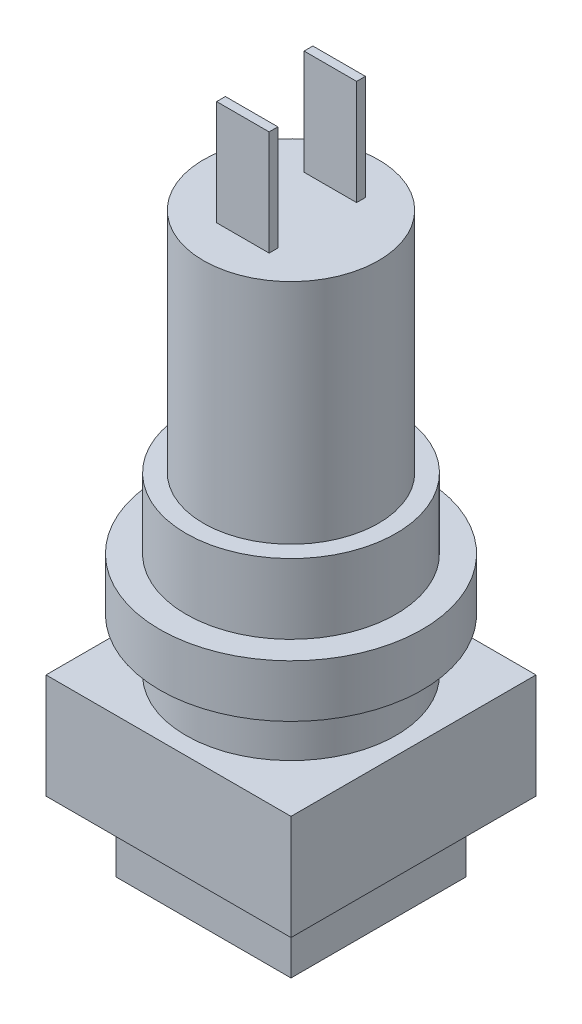
ISO-10303-21;
HEADER;
FILE_DESCRIPTION(('STEP AP214'),'2;1');
FILE_NAME('part.step','',(''),(''),'','','');
FILE_SCHEMA(('AUTOMOTIVE_DESIGN { 1 0 10303 214 1 1 1 1 }'));
ENDSEC;
DATA;
#1=APPLICATION_CONTEXT('core data for automotive mechanical design processes');
#2=APPLICATION_PROTOCOL_DEFINITION('international standard','automotive_design',2000,#1);
#3=PRODUCT_CONTEXT('',#1,'mechanical');
#4=PRODUCT('Part','Part','',(#3));
#5=PRODUCT_RELATED_PRODUCT_CATEGORY('part','',(#4));
#6=PRODUCT_DEFINITION_FORMATION('','',#4);
#7=PRODUCT_DEFINITION_CONTEXT('part definition',#1,'design');
#8=PRODUCT_DEFINITION('design','',#6,#7);
#9=PRODUCT_DEFINITION_SHAPE('','',#8);
#10=(LENGTH_UNIT() NAMED_UNIT(*) SI_UNIT(.MILLI.,.METRE.));
#11=(NAMED_UNIT(*) PLANE_ANGLE_UNIT() SI_UNIT($,.RADIAN.));
#12=(NAMED_UNIT(*) SI_UNIT($,.STERADIAN.) SOLID_ANGLE_UNIT());
#13=UNCERTAINTY_MEASURE_WITH_UNIT(LENGTH_MEASURE(1.E-05),#10,'distance_accuracy_value','');
#14=(GEOMETRIC_REPRESENTATION_CONTEXT(3) GLOBAL_UNCERTAINTY_ASSIGNED_CONTEXT((#13)) GLOBAL_UNIT_ASSIGNED_CONTEXT((#10,
#11,#12)) REPRESENTATION_CONTEXT('',''));
#15=CARTESIAN_POINT('',(0.,0.,0.));
#16=DIRECTION('',(0.,0.,1.));
#17=DIRECTION('',(1.,0.,0.));
#18=AXIS2_PLACEMENT_3D('',#15,#16,#17);
#19=CARTESIAN_POINT('',(0.,33.,0.));
#20=DIRECTION('',(0.,1.,0.));
#21=DIRECTION('',(0.,0.,1.));
#22=AXIS2_PLACEMENT_3D('',#19,#20,#21);
#23=PLANE('',#22);
#24=CARTESIAN_POINT('',(0.,33.,0.));
#25=DIRECTION('',(0.,1.,0.));
#26=DIRECTION('',(0.,0.,1.));
#27=AXIS2_PLACEMENT_3D('',#24,#25,#26);
#28=CIRCLE('',#27,5.);
#29=CARTESIAN_POINT('',(0.,33.,5.));
#30=VERTEX_POINT('',#29);
#31=EDGE_CURVE('E210',#30,#30,#28,.T.);
#32=ORIENTED_EDGE('',*,*,#31,.T.);
#33=EDGE_LOOP('',(#32));
#34=FACE_BOUND('',#33,.T.);
#35=DIRECTION('',(0.,0.,-1.));
#36=VECTOR('',#35,1.);
#37=CARTESIAN_POINT('',(1.5,33.,0.));
#38=LINE('',#37,#36);
#39=CARTESIAN_POINT('',(1.5,33.,-2.25));
#40=VERTEX_POINT('',#39);
#41=CARTESIAN_POINT('',(1.5,33.,-2.75));
#42=VERTEX_POINT('',#41);
#43=EDGE_CURVE('E193',#40,#42,#38,.T.);
#44=ORIENTED_EDGE('',*,*,#43,.F.);
#45=DIRECTION('',(1.,0.,0.));
#46=VECTOR('',#45,1.);
#47=CARTESIAN_POINT('',(0.,33.,-2.25));
#48=LINE('',#47,#46);
#49=CARTESIAN_POINT('',(-1.5,33.,-2.25));
#50=VERTEX_POINT('',#49);
#51=EDGE_CURVE('E152',#50,#40,#48,.T.);
#52=ORIENTED_EDGE('',*,*,#51,.F.);
#53=DIRECTION('',(0.,0.,-1.));
#54=VECTOR('',#53,1.);
#55=CARTESIAN_POINT('',(-1.5,33.,0.));
#56=LINE('',#55,#54);
#57=CARTESIAN_POINT('',(-1.5,33.,-2.75));
#58=VERTEX_POINT('',#57);
#59=EDGE_CURVE('E182',#50,#58,#56,.T.);
#60=ORIENTED_EDGE('',*,*,#59,.T.);
#61=DIRECTION('',(1.,0.,0.));
#62=VECTOR('',#61,1.);
#63=CARTESIAN_POINT('',(0.,33.,-2.75));
#64=LINE('',#63,#62);
#65=EDGE_CURVE('E196',#58,#42,#64,.T.);
#66=ORIENTED_EDGE('',*,*,#65,.T.);
#67=EDGE_LOOP('',(#44,#52,#60,#66));
#68=FACE_BOUND('',#67,.T.);
#69=DIRECTION('',(1.,0.,0.));
#70=VECTOR('',#69,1.);
#71=CARTESIAN_POINT('',(-1.5,33.,2.75));
#72=LINE('',#71,#70);
#73=CARTESIAN_POINT('',(-1.5,33.,2.75));
#74=VERTEX_POINT('',#73);
#75=CARTESIAN_POINT('',(1.5,33.,2.75));
#76=VERTEX_POINT('',#75);
#77=EDGE_CURVE('E50',#74,#76,#72,.T.);
#78=ORIENTED_EDGE('',*,*,#77,.F.);
#79=DIRECTION('',(0.,0.,1.));
#80=VECTOR('',#79,1.);
#81=CARTESIAN_POINT('',(-1.5,33.,2.25));
#82=LINE('',#81,#80);
#83=CARTESIAN_POINT('',(-1.5,33.,2.25));
#84=VERTEX_POINT('',#83);
#85=EDGE_CURVE('E145',#84,#74,#82,.T.);
#86=ORIENTED_EDGE('',*,*,#85,.F.);
#87=DIRECTION('',(1.,0.,0.));
#88=VECTOR('',#87,1.);
#89=CARTESIAN_POINT('',(-1.5,33.,2.25));
#90=LINE('',#89,#88);
#91=CARTESIAN_POINT('',(1.5,33.,2.25));
#92=VERTEX_POINT('',#91);
#93=EDGE_CURVE('E148',#84,#92,#90,.T.);
#94=ORIENTED_EDGE('',*,*,#93,.T.);
#95=DIRECTION('',(0.,0.,1.));
#96=VECTOR('',#95,1.);
#97=CARTESIAN_POINT('',(1.5,33.,2.25));
#98=LINE('',#97,#96);
#99=EDGE_CURVE('E55',#92,#76,#98,.T.);
#100=ORIENTED_EDGE('',*,*,#99,.T.);
#101=EDGE_LOOP('',(#78,#86,#94,#100));
#102=FACE_BOUND('',#101,.T.);
#103=ADVANCED_FACE('F33',(#34,#68,#102),#23,.T.);
#104=CARTESIAN_POINT('',(-5.,4.,5.));
#105=DIRECTION('',(1.,0.,0.));
#106=DIRECTION('',(0.,0.,-1.));
#107=AXIS2_PLACEMENT_3D('',#104,#105,#106);
#108=PLANE('',#107);
#109=DIRECTION('',(0.,0.,1.));
#110=VECTOR('',#109,1.);
#111=CARTESIAN_POINT('',(-5.,0.,5.));
#112=LINE('',#111,#110);
#113=CARTESIAN_POINT('',(-5.,0.,-5.));
#114=VERTEX_POINT('',#113);
#115=CARTESIAN_POINT('',(-5.,0.,5.));
#116=VERTEX_POINT('',#115);
#117=EDGE_CURVE('E260',#114,#116,#112,.T.);
#118=ORIENTED_EDGE('',*,*,#117,.T.);
#119=DIRECTION('',(0.,-1.,0.));
#120=VECTOR('',#119,1.);
#121=CARTESIAN_POINT('',(-5.,4.,5.));
#122=LINE('',#121,#120);
#123=CARTESIAN_POINT('',(-5.,4.,5.));
#124=VERTEX_POINT('',#123);
#125=EDGE_CURVE('E37',#124,#116,#122,.T.);
#126=ORIENTED_EDGE('',*,*,#125,.F.);
#127=DIRECTION('',(0.,0.,1.));
#128=VECTOR('',#127,1.);
#129=CARTESIAN_POINT('',(-5.,4.,5.));
#130=LINE('',#129,#128);
#131=CARTESIAN_POINT('',(-5.,4.,-5.));
#132=VERTEX_POINT('',#131);
#133=EDGE_CURVE('E261',#132,#124,#130,.T.);
#134=ORIENTED_EDGE('',*,*,#133,.F.);
#135=DIRECTION('',(0.,-1.,0.));
#136=VECTOR('',#135,1.);
#137=CARTESIAN_POINT('',(-5.,4.,-5.));
#138=LINE('',#137,#136);
#139=EDGE_CURVE('E274',#132,#114,#138,.T.);
#140=ORIENTED_EDGE('',*,*,#139,.T.);
#141=EDGE_LOOP('',(#118,#126,#134,#140));
#142=FACE_BOUND('',#141,.T.);
#143=ADVANCED_FACE('F35',(#142),#108,.F.);
#144=CARTESIAN_POINT('',(5.,4.,5.));
#145=DIRECTION('',(0.,0.,-1.));
#146=DIRECTION('',(-1.,0.,0.));
#147=AXIS2_PLACEMENT_3D('',#144,#145,#146);
#148=PLANE('',#147);
#149=DIRECTION('',(1.,0.,0.));
#150=VECTOR('',#149,1.);
#151=CARTESIAN_POINT('',(5.,0.,5.));
#152=LINE('',#151,#150);
#153=CARTESIAN_POINT('',(5.,0.,5.));
#154=VERTEX_POINT('',#153);
#155=EDGE_CURVE('E277',#116,#154,#152,.T.);
#156=ORIENTED_EDGE('',*,*,#155,.T.);
#157=DIRECTION('',(0.,-1.,0.));
#158=VECTOR('',#157,1.);
#159=CARTESIAN_POINT('',(5.,4.,5.));
#160=LINE('',#159,#158);
#161=CARTESIAN_POINT('',(5.,4.,5.));
#162=VERTEX_POINT('',#161);
#163=EDGE_CURVE('E286',#162,#154,#160,.T.);
#164=ORIENTED_EDGE('',*,*,#163,.F.);
#165=DIRECTION('',(1.,0.,0.));
#166=VECTOR('',#165,1.);
#167=CARTESIAN_POINT('',(5.,4.,5.));
#168=LINE('',#167,#166);
#169=EDGE_CURVE('E264',#124,#162,#168,.T.);
#170=ORIENTED_EDGE('',*,*,#169,.F.);
#171=ORIENTED_EDGE('',*,*,#125,.T.);
#172=EDGE_LOOP('',(#156,#164,#170,#171));
#173=FACE_BOUND('',#172,.T.);
#174=ADVANCED_FACE('F294',(#173),#148,.F.);
#175=CARTESIAN_POINT('',(5.,4.,5.));
#176=DIRECTION('',(-1.,0.,0.));
#177=DIRECTION('',(0.,0.,1.));
#178=AXIS2_PLACEMENT_3D('',#175,#176,#177);
#179=PLANE('',#178);
#180=DIRECTION('',(0.,0.,-1.));
#181=VECTOR('',#180,1.);
#182=CARTESIAN_POINT('',(5.,0.,5.));
#183=LINE('',#182,#181);
#184=CARTESIAN_POINT('',(5.,0.,-5.));
#185=VERTEX_POINT('',#184);
#186=EDGE_CURVE('E279',#154,#185,#183,.T.);
#187=ORIENTED_EDGE('',*,*,#186,.T.);
#188=DIRECTION('',(0.,-1.,0.));
#189=VECTOR('',#188,1.);
#190=CARTESIAN_POINT('',(5.,4.,-5.));
#191=LINE('',#190,#189);
#192=CARTESIAN_POINT('',(5.,4.,-5.));
#193=VERTEX_POINT('',#192);
#194=EDGE_CURVE('E284',#193,#185,#191,.T.);
#195=ORIENTED_EDGE('',*,*,#194,.F.);
#196=DIRECTION('',(0.,0.,-1.));
#197=VECTOR('',#196,1.);
#198=CARTESIAN_POINT('',(5.,4.,5.));
#199=LINE('',#198,#197);
#200=EDGE_CURVE('E268',#162,#193,#199,.T.);
#201=ORIENTED_EDGE('',*,*,#200,.F.);
#202=ORIENTED_EDGE('',*,*,#163,.T.);
#203=EDGE_LOOP('',(#187,#195,#201,#202));
#204=FACE_BOUND('',#203,.T.);
#205=ADVANCED_FACE('F301',(#204),#179,.F.);
#206=CARTESIAN_POINT('',(5.,4.,-5.));
#207=DIRECTION('',(0.,0.,1.));
#208=DIRECTION('',(1.,0.,0.));
#209=AXIS2_PLACEMENT_3D('',#206,#207,#208);
#210=PLANE('',#209);
#211=DIRECTION('',(-1.,0.,0.));
#212=VECTOR('',#211,1.);
#213=CARTESIAN_POINT('',(5.,0.,-5.));
#214=LINE('',#213,#212);
#215=EDGE_CURVE('E265',#185,#114,#214,.T.);
#216=ORIENTED_EDGE('',*,*,#215,.T.);
#217=ORIENTED_EDGE('',*,*,#139,.F.);
#218=DIRECTION('',(-1.,0.,0.));
#219=VECTOR('',#218,1.);
#220=CARTESIAN_POINT('',(5.,4.,-5.));
#221=LINE('',#220,#219);
#222=EDGE_CURVE('E271',#193,#132,#221,.T.);
#223=ORIENTED_EDGE('',*,*,#222,.F.);
#224=ORIENTED_EDGE('',*,*,#194,.T.);
#225=EDGE_LOOP('',(#216,#217,#223,#224));
#226=FACE_BOUND('',#225,.T.);
#227=ADVANCED_FACE('F304',(#226),#210,.F.);
#228=CARTESIAN_POINT('',(0.,0.,0.));
#229=DIRECTION('',(0.,1.,0.));
#230=DIRECTION('',(0.,0.,1.));
#231=AXIS2_PLACEMENT_3D('',#228,#229,#230);
#232=PLANE('',#231);
#233=ORIENTED_EDGE('',*,*,#117,.F.);
#234=ORIENTED_EDGE('',*,*,#215,.F.);
#235=ORIENTED_EDGE('',*,*,#186,.F.);
#236=ORIENTED_EDGE('',*,*,#155,.F.);
#237=EDGE_LOOP('',(#233,#234,#235,#236));
#238=FACE_BOUND('',#237,.T.);
#239=ADVANCED_FACE('F300',(#238),#232,.F.);
#240=CARTESIAN_POINT('',(0.,4.,0.));
#241=DIRECTION('',(0.,1.,0.));
#242=DIRECTION('',(0.,0.,1.));
#243=AXIS2_PLACEMENT_3D('',#240,#241,#242);
#244=PLANE('',#243);
#245=DIRECTION('',(0.,0.,-1.));
#246=VECTOR('',#245,1.);
#247=CARTESIAN_POINT('',(7.,4.,-7.));
#248=LINE('',#247,#246);
#249=CARTESIAN_POINT('',(7.,4.,7.));
#250=VERTEX_POINT('',#249);
#251=CARTESIAN_POINT('',(7.,4.,-7.));
#252=VERTEX_POINT('',#251);
#253=EDGE_CURVE('E228',#250,#252,#248,.T.);
#254=ORIENTED_EDGE('',*,*,#253,.F.);
#255=DIRECTION('',(1.,0.,0.));
#256=VECTOR('',#255,1.);
#257=CARTESIAN_POINT('',(-7.,4.,7.));
#258=LINE('',#257,#256);
#259=CARTESIAN_POINT('',(-7.,4.,7.));
#260=VERTEX_POINT('',#259);
#261=EDGE_CURVE('E235',#260,#250,#258,.T.);
#262=ORIENTED_EDGE('',*,*,#261,.F.);
#263=DIRECTION('',(0.,0.,1.));
#264=VECTOR('',#263,1.);
#265=CARTESIAN_POINT('',(-7.,4.,-7.));
#266=LINE('',#265,#264);
#267=CARTESIAN_POINT('',(-7.,4.,-7.));
#268=VERTEX_POINT('',#267);
#269=EDGE_CURVE('E246',#268,#260,#266,.T.);
#270=ORIENTED_EDGE('',*,*,#269,.F.);
#271=DIRECTION('',(-1.,0.,0.));
#272=VECTOR('',#271,1.);
#273=CARTESIAN_POINT('',(-7.,4.,-7.));
#274=LINE('',#273,#272);
#275=EDGE_CURVE('E244',#252,#268,#274,.T.);
#276=ORIENTED_EDGE('',*,*,#275,.F.);
#277=EDGE_LOOP('',(#254,#262,#270,#276));
#278=FACE_BOUND('',#277,.T.);
#279=ORIENTED_EDGE('',*,*,#222,.T.);
#280=ORIENTED_EDGE('',*,*,#133,.T.);
#281=ORIENTED_EDGE('',*,*,#169,.T.);
#282=ORIENTED_EDGE('',*,*,#200,.T.);
#283=EDGE_LOOP('',(#279,#280,#281,#282));
#284=FACE_BOUND('',#283,.T.);
#285=ADVANCED_FACE('F306',(#278,#284),#244,.F.);
#286=CARTESIAN_POINT('',(7.,10.,-7.));
#287=DIRECTION('',(-1.,0.,0.));
#288=DIRECTION('',(0.,0.,1.));
#289=AXIS2_PLACEMENT_3D('',#286,#287,#288);
#290=PLANE('',#289);
#291=ORIENTED_EDGE('',*,*,#253,.T.);
#292=DIRECTION('',(0.,-1.,0.));
#293=VECTOR('',#292,1.);
#294=CARTESIAN_POINT('',(7.,10.,-7.));
#295=LINE('',#294,#293);
#296=CARTESIAN_POINT('',(7.,10.,-7.));
#297=VERTEX_POINT('',#296);
#298=EDGE_CURVE('E257',#297,#252,#295,.T.);
#299=ORIENTED_EDGE('',*,*,#298,.F.);
#300=DIRECTION('',(0.,0.,-1.));
#301=VECTOR('',#300,1.);
#302=CARTESIAN_POINT('',(7.,10.,-7.));
#303=LINE('',#302,#301);
#304=CARTESIAN_POINT('',(7.,10.,7.));
#305=VERTEX_POINT('',#304);
#306=EDGE_CURVE('E231',#305,#297,#303,.T.);
#307=ORIENTED_EDGE('',*,*,#306,.F.);
#308=DIRECTION('',(0.,-1.,0.));
#309=VECTOR('',#308,1.);
#310=CARTESIAN_POINT('',(7.,10.,7.));
#311=LINE('',#310,#309);
#312=EDGE_CURVE('E241',#305,#250,#311,.T.);
#313=ORIENTED_EDGE('',*,*,#312,.T.);
#314=EDGE_LOOP('',(#291,#299,#307,#313));
#315=FACE_BOUND('',#314,.T.);
#316=ADVANCED_FACE('F308',(#315),#290,.F.);
#317=CARTESIAN_POINT('',(-7.,10.,-7.));
#318=DIRECTION('',(0.,0.,1.));
#319=DIRECTION('',(1.,0.,0.));
#320=AXIS2_PLACEMENT_3D('',#317,#318,#319);
#321=PLANE('',#320);
#322=ORIENTED_EDGE('',*,*,#275,.T.);
#323=DIRECTION('',(0.,-1.,0.));
#324=VECTOR('',#323,1.);
#325=CARTESIAN_POINT('',(-7.,10.,-7.));
#326=LINE('',#325,#324);
#327=CARTESIAN_POINT('',(-7.,10.,-7.));
#328=VERTEX_POINT('',#327);
#329=EDGE_CURVE('E254',#328,#268,#326,.T.);
#330=ORIENTED_EDGE('',*,*,#329,.F.);
#331=DIRECTION('',(-1.,0.,0.));
#332=VECTOR('',#331,1.);
#333=CARTESIAN_POINT('',(-7.,10.,-7.));
#334=LINE('',#333,#332);
#335=EDGE_CURVE('E234',#297,#328,#334,.T.);
#336=ORIENTED_EDGE('',*,*,#335,.F.);
#337=ORIENTED_EDGE('',*,*,#298,.T.);
#338=EDGE_LOOP('',(#322,#330,#336,#337));
#339=FACE_BOUND('',#338,.T.);
#340=ADVANCED_FACE('F315',(#339),#321,.F.);
#341=CARTESIAN_POINT('',(-7.,10.,-7.));
#342=DIRECTION('',(1.,0.,0.));
#343=DIRECTION('',(0.,0.,-1.));
#344=AXIS2_PLACEMENT_3D('',#341,#342,#343);
#345=PLANE('',#344);
#346=ORIENTED_EDGE('',*,*,#269,.T.);
#347=DIRECTION('',(0.,-1.,0.));
#348=VECTOR('',#347,1.);
#349=CARTESIAN_POINT('',(-7.,10.,7.));
#350=LINE('',#349,#348);
#351=CARTESIAN_POINT('',(-7.,10.,7.));
#352=VERTEX_POINT('',#351);
#353=EDGE_CURVE('E251',#352,#260,#350,.T.);
#354=ORIENTED_EDGE('',*,*,#353,.F.);
#355=DIRECTION('',(0.,0.,1.));
#356=VECTOR('',#355,1.);
#357=CARTESIAN_POINT('',(-7.,10.,-7.));
#358=LINE('',#357,#356);
#359=EDGE_CURVE('E237',#328,#352,#358,.T.);
#360=ORIENTED_EDGE('',*,*,#359,.F.);
#361=ORIENTED_EDGE('',*,*,#329,.T.);
#362=EDGE_LOOP('',(#346,#354,#360,#361));
#363=FACE_BOUND('',#362,.T.);
#364=ADVANCED_FACE('F367',(#363),#345,.F.);
#365=CARTESIAN_POINT('',(-7.,10.,7.));
#366=DIRECTION('',(0.,0.,-1.));
#367=DIRECTION('',(-1.,0.,0.));
#368=AXIS2_PLACEMENT_3D('',#365,#366,#367);
#369=PLANE('',#368);
#370=ORIENTED_EDGE('',*,*,#261,.T.);
#371=ORIENTED_EDGE('',*,*,#312,.F.);
#372=DIRECTION('',(1.,0.,0.));
#373=VECTOR('',#372,1.);
#374=CARTESIAN_POINT('',(-7.,10.,7.));
#375=LINE('',#374,#373);
#376=EDGE_CURVE('E239',#352,#305,#375,.T.);
#377=ORIENTED_EDGE('',*,*,#376,.F.);
#378=ORIENTED_EDGE('',*,*,#353,.T.);
#379=EDGE_LOOP('',(#370,#371,#377,#378));
#380=FACE_BOUND('',#379,.T.);
#381=ADVANCED_FACE('F362',(#380),#369,.F.);
#382=CARTESIAN_POINT('',(0.,10.,0.));
#383=DIRECTION('',(0.,1.,0.));
#384=DIRECTION('',(0.,0.,1.));
#385=AXIS2_PLACEMENT_3D('',#382,#383,#384);
#386=PLANE('',#385);
#387=CARTESIAN_POINT('',(0.,10.,0.));
#388=DIRECTION('',(0.,1.,0.));
#389=DIRECTION('',(0.,0.,1.));
#390=AXIS2_PLACEMENT_3D('',#387,#388,#389);
#391=CIRCLE('',#390,6.);
#392=CARTESIAN_POINT('',(0.,10.,6.));
#393=VERTEX_POINT('',#392);
#394=EDGE_CURVE('E219',#393,#393,#391,.T.);
#395=ORIENTED_EDGE('',*,*,#394,.F.);
#396=EDGE_LOOP('',(#395));
#397=FACE_BOUND('',#396,.T.);
#398=ORIENTED_EDGE('',*,*,#306,.T.);
#399=ORIENTED_EDGE('',*,*,#335,.T.);
#400=ORIENTED_EDGE('',*,*,#359,.T.);
#401=ORIENTED_EDGE('',*,*,#376,.T.);
#402=EDGE_LOOP('',(#398,#399,#400,#401));
#403=FACE_BOUND('',#402,.T.);
#404=ADVANCED_FACE('F359',(#397,#403),#386,.T.);
#405=CARTESIAN_POINT('',(0.,13.,0.));
#406=DIRECTION('',(0.,-1.,0.));
#407=DIRECTION('',(0.,0.,-1.));
#408=AXIS2_PLACEMENT_3D('',#405,#406,#407);
#409=CYLINDRICAL_SURFACE('',#408,6.);
#410=CARTESIAN_POINT('',(0.,13.,0.));
#411=DIRECTION('',(0.,1.,0.));
#412=DIRECTION('',(0.,0.,1.));
#413=AXIS2_PLACEMENT_3D('',#410,#411,#412);
#414=CIRCLE('',#413,6.);
#415=CARTESIAN_POINT('',(0.,13.,6.));
#416=VERTEX_POINT('',#415);
#417=EDGE_CURVE('E223',#416,#416,#414,.T.);
#418=ORIENTED_EDGE('',*,*,#417,.F.);
#419=EDGE_LOOP('',(#418));
#420=FACE_BOUND('',#419,.T.);
#421=ORIENTED_EDGE('',*,*,#394,.T.);
#422=EDGE_LOOP('',(#421));
#423=FACE_BOUND('',#422,.T.);
#424=ADVANCED_FACE('F356',(#420,#423),#409,.T.);
#425=CARTESIAN_POINT('',(0.,16.,0.));
#426=DIRECTION('',(0.,-1.,0.));
#427=DIRECTION('',(0.,0.,-1.));
#428=AXIS2_PLACEMENT_3D('',#425,#426,#427);
#429=CYLINDRICAL_SURFACE('',#428,7.5);
#430=CARTESIAN_POINT('',(0.,16.,0.));
#431=DIRECTION('',(0.,1.,0.));
#432=DIRECTION('',(0.,0.,1.));
#433=AXIS2_PLACEMENT_3D('',#430,#431,#432);
#434=CIRCLE('',#433,7.5);
#435=CARTESIAN_POINT('',(0.,16.,7.5));
#436=VERTEX_POINT('',#435);
#437=EDGE_CURVE('E220',#436,#436,#434,.T.);
#438=ORIENTED_EDGE('',*,*,#437,.F.);
#439=EDGE_LOOP('',(#438));
#440=FACE_BOUND('',#439,.T.);
#441=CARTESIAN_POINT('',(0.,13.,0.));
#442=DIRECTION('',(0.,1.,0.));
#443=DIRECTION('',(0.,0.,1.));
#444=AXIS2_PLACEMENT_3D('',#441,#442,#443);
#445=CIRCLE('',#444,7.5);
#446=CARTESIAN_POINT('',(0.,13.,7.5));
#447=VERTEX_POINT('',#446);
#448=EDGE_CURVE('E216',#447,#447,#445,.T.);
#449=ORIENTED_EDGE('',*,*,#448,.T.);
#450=EDGE_LOOP('',(#449));
#451=FACE_BOUND('',#450,.T.);
#452=ADVANCED_FACE('F349',(#440,#451),#429,.T.);
#453=CARTESIAN_POINT('',(0.,16.,0.));
#454=DIRECTION('',(0.,1.,0.));
#455=DIRECTION('',(0.,0.,1.));
#456=AXIS2_PLACEMENT_3D('',#453,#454,#455);
#457=PLANE('',#456);
#458=CARTESIAN_POINT('',(0.,16.,0.));
#459=DIRECTION('',(0.,1.,0.));
#460=DIRECTION('',(0.,0.,1.));
#461=AXIS2_PLACEMENT_3D('',#458,#459,#460);
#462=CIRCLE('',#461,6.);
#463=CARTESIAN_POINT('',(0.,16.,6.));
#464=VERTEX_POINT('',#463);
#465=EDGE_CURVE('E42',#464,#464,#462,.T.);
#466=ORIENTED_EDGE('',*,*,#465,.F.);
#467=EDGE_LOOP('',(#466));
#468=FACE_BOUND('',#467,.T.);
#469=ORIENTED_EDGE('',*,*,#437,.T.);
#470=EDGE_LOOP('',(#469));
#471=FACE_BOUND('',#470,.T.);
#472=ADVANCED_FACE('F346',(#468,#471),#457,.T.);
#473=CARTESIAN_POINT('',(0.,13.,0.));
#474=DIRECTION('',(0.,1.,0.));
#475=DIRECTION('',(0.,0.,1.));
#476=AXIS2_PLACEMENT_3D('',#473,#474,#475);
#477=PLANE('',#476);
#478=ORIENTED_EDGE('',*,*,#417,.T.);
#479=EDGE_LOOP('',(#478));
#480=FACE_BOUND('',#479,.T.);
#481=ORIENTED_EDGE('',*,*,#448,.F.);
#482=EDGE_LOOP('',(#481));
#483=FACE_BOUND('',#482,.T.);
#484=ADVANCED_FACE('F344',(#480,#483),#477,.F.);
#485=CARTESIAN_POINT('',(0.,20.,0.));
#486=DIRECTION('',(0.,-1.,0.));
#487=DIRECTION('',(0.,0.,-1.));
#488=AXIS2_PLACEMENT_3D('',#485,#486,#487);
#489=CYLINDRICAL_SURFACE('',#488,6.);
#490=CARTESIAN_POINT('',(0.,20.,0.));
#491=DIRECTION('',(0.,1.,0.));
#492=DIRECTION('',(0.,0.,1.));
#493=AXIS2_PLACEMENT_3D('',#490,#491,#492);
#494=CIRCLE('',#493,6.);
#495=CARTESIAN_POINT('',(0.,20.,6.));
#496=VERTEX_POINT('',#495);
#497=EDGE_CURVE('E212',#496,#496,#494,.T.);
#498=ORIENTED_EDGE('',*,*,#497,.F.);
#499=EDGE_LOOP('',(#498));
#500=FACE_BOUND('',#499,.T.);
#501=ORIENTED_EDGE('',*,*,#465,.T.);
#502=EDGE_LOOP('',(#501));
#503=FACE_BOUND('',#502,.T.);
#504=ADVANCED_FACE('F340',(#500,#503),#489,.T.);
#505=CARTESIAN_POINT('',(0.,20.,0.));
#506=DIRECTION('',(0.,1.,0.));
#507=DIRECTION('',(0.,0.,1.));
#508=AXIS2_PLACEMENT_3D('',#505,#506,#507);
#509=PLANE('',#508);
#510=CARTESIAN_POINT('',(0.,20.,0.));
#511=DIRECTION('',(0.,1.,0.));
#512=DIRECTION('',(0.,0.,1.));
#513=AXIS2_PLACEMENT_3D('',#510,#511,#512);
#514=CIRCLE('',#513,5.);
#515=CARTESIAN_POINT('',(0.,20.,5.));
#516=VERTEX_POINT('',#515);
#517=EDGE_CURVE('E11',#516,#516,#514,.T.);
#518=ORIENTED_EDGE('',*,*,#517,.F.);
#519=EDGE_LOOP('',(#518));
#520=FACE_BOUND('',#519,.T.);
#521=ORIENTED_EDGE('',*,*,#497,.T.);
#522=EDGE_LOOP('',(#521));
#523=FACE_BOUND('',#522,.T.);
#524=ADVANCED_FACE('F336',(#520,#523),#509,.T.);
#525=CARTESIAN_POINT('',(0.,33.,0.));
#526=DIRECTION('',(0.,-1.,0.));
#527=DIRECTION('',(0.,0.,-1.));
#528=AXIS2_PLACEMENT_3D('',#525,#526,#527);
#529=CYLINDRICAL_SURFACE('',#528,5.);
#530=ORIENTED_EDGE('',*,*,#31,.F.);
#531=EDGE_LOOP('',(#530));
#532=FACE_BOUND('',#531,.T.);
#533=ORIENTED_EDGE('',*,*,#517,.T.);
#534=EDGE_LOOP('',(#533));
#535=FACE_BOUND('',#534,.T.);
#536=ADVANCED_FACE('F333',(#532,#535),#529,.T.);
#537=CARTESIAN_POINT('',(0.,39.,-2.25));
#538=DIRECTION('',(0.,0.,-1.));
#539=DIRECTION('',(-1.,0.,0.));
#540=AXIS2_PLACEMENT_3D('',#537,#538,#539);
#541=PLANE('',#540);
#542=ORIENTED_EDGE('',*,*,#51,.T.);
#543=DIRECTION('',(0.,-1.,0.));
#544=VECTOR('',#543,1.);
#545=CARTESIAN_POINT('',(1.5,39.,-2.25));
#546=LINE('',#545,#544);
#547=CARTESIAN_POINT('',(1.5,39.,-2.25));
#548=VERTEX_POINT('',#547);
#549=EDGE_CURVE('E207',#548,#40,#546,.T.);
#550=ORIENTED_EDGE('',*,*,#549,.F.);
#551=DIRECTION('',(1.,0.,0.));
#552=VECTOR('',#551,1.);
#553=CARTESIAN_POINT('',(0.,39.,-2.25));
#554=LINE('',#553,#552);
#555=CARTESIAN_POINT('',(-1.5,39.,-2.25));
#556=VERTEX_POINT('',#555);
#557=EDGE_CURVE('E178',#556,#548,#554,.T.);
#558=ORIENTED_EDGE('',*,*,#557,.F.);
#559=DIRECTION('',(0.,-1.,0.));
#560=VECTOR('',#559,1.);
#561=CARTESIAN_POINT('',(-1.5,39.,-2.25));
#562=LINE('',#561,#560);
#563=EDGE_CURVE('E190',#556,#50,#562,.T.);
#564=ORIENTED_EDGE('',*,*,#563,.T.);
#565=EDGE_LOOP('',(#542,#550,#558,#564));
#566=FACE_BOUND('',#565,.T.);
#567=ADVANCED_FACE('F331',(#566),#541,.F.);
#568=CARTESIAN_POINT('',(1.5,39.,0.));
#569=DIRECTION('',(-1.,0.,0.));
#570=DIRECTION('',(0.,0.,1.));
#571=AXIS2_PLACEMENT_3D('',#568,#569,#570);
#572=PLANE('',#571);
#573=ORIENTED_EDGE('',*,*,#43,.T.);
#574=DIRECTION('',(0.,-1.,0.));
#575=VECTOR('',#574,1.);
#576=CARTESIAN_POINT('',(1.5,39.,-2.75));
#577=LINE('',#576,#575);
#578=CARTESIAN_POINT('',(1.5,39.,-2.75));
#579=VERTEX_POINT('',#578);
#580=EDGE_CURVE('E204',#579,#42,#577,.T.);
#581=ORIENTED_EDGE('',*,*,#580,.F.);
#582=DIRECTION('',(0.,0.,-1.));
#583=VECTOR('',#582,1.);
#584=CARTESIAN_POINT('',(1.5,39.,0.));
#585=LINE('',#584,#583);
#586=EDGE_CURVE('E181',#548,#579,#585,.T.);
#587=ORIENTED_EDGE('',*,*,#586,.F.);
#588=ORIENTED_EDGE('',*,*,#549,.T.);
#589=EDGE_LOOP('',(#573,#581,#587,#588));
#590=FACE_BOUND('',#589,.T.);
#591=ADVANCED_FACE('F495',(#590),#572,.F.);
#592=CARTESIAN_POINT('',(0.,39.,-2.75));
#593=DIRECTION('',(0.,0.,-1.));
#594=DIRECTION('',(-1.,0.,0.));
#595=AXIS2_PLACEMENT_3D('',#592,#593,#594);
#596=PLANE('',#595);
#597=ORIENTED_EDGE('',*,*,#65,.F.);
#598=DIRECTION('',(0.,-1.,0.));
#599=VECTOR('',#598,1.);
#600=CARTESIAN_POINT('',(-1.5,39.,-2.75));
#601=LINE('',#600,#599);
#602=CARTESIAN_POINT('',(-1.5,39.,-2.75));
#603=VERTEX_POINT('',#602);
#604=EDGE_CURVE('E201',#603,#58,#601,.T.);
#605=ORIENTED_EDGE('',*,*,#604,.F.);
#606=DIRECTION('',(1.,0.,0.));
#607=VECTOR('',#606,1.);
#608=CARTESIAN_POINT('',(0.,39.,-2.75));
#609=LINE('',#608,#607);
#610=EDGE_CURVE('E184',#603,#579,#609,.T.);
#611=ORIENTED_EDGE('',*,*,#610,.T.);
#612=ORIENTED_EDGE('',*,*,#580,.T.);
#613=EDGE_LOOP('',(#597,#605,#611,#612));
#614=FACE_BOUND('',#613,.T.);
#615=ADVANCED_FACE('F503',(#614),#596,.T.);
#616=CARTESIAN_POINT('',(-1.5,39.,0.));
#617=DIRECTION('',(-1.,0.,0.));
#618=DIRECTION('',(0.,0.,1.));
#619=AXIS2_PLACEMENT_3D('',#616,#617,#618);
#620=PLANE('',#619);
#621=ORIENTED_EDGE('',*,*,#59,.F.);
#622=ORIENTED_EDGE('',*,*,#563,.F.);
#623=DIRECTION('',(0.,0.,-1.));
#624=VECTOR('',#623,1.);
#625=CARTESIAN_POINT('',(-1.5,39.,0.));
#626=LINE('',#625,#624);
#627=EDGE_CURVE('E187',#556,#603,#626,.T.);
#628=ORIENTED_EDGE('',*,*,#627,.T.);
#629=ORIENTED_EDGE('',*,*,#604,.T.);
#630=EDGE_LOOP('',(#621,#622,#628,#629));
#631=FACE_BOUND('',#630,.T.);
#632=ADVANCED_FACE('F511',(#631),#620,.T.);
#633=CARTESIAN_POINT('',(0.,39.,0.));
#634=DIRECTION('',(0.,1.,0.));
#635=DIRECTION('',(0.,0.,1.));
#636=AXIS2_PLACEMENT_3D('',#633,#634,#635);
#637=PLANE('',#636);
#638=ORIENTED_EDGE('',*,*,#557,.T.);
#639=ORIENTED_EDGE('',*,*,#586,.T.);
#640=ORIENTED_EDGE('',*,*,#610,.F.);
#641=ORIENTED_EDGE('',*,*,#627,.F.);
#642=EDGE_LOOP('',(#638,#639,#640,#641));
#643=FACE_BOUND('',#642,.T.);
#644=ADVANCED_FACE('F520',(#643),#637,.T.);
#645=CARTESIAN_POINT('',(-1.5,39.,2.25));
#646=DIRECTION('',(1.,0.,0.));
#647=DIRECTION('',(0.,0.,-1.));
#648=AXIS2_PLACEMENT_3D('',#645,#646,#647);
#649=PLANE('',#648);
#650=ORIENTED_EDGE('',*,*,#85,.T.);
#651=DIRECTION('',(0.,-1.,0.));
#652=VECTOR('',#651,1.);
#653=CARTESIAN_POINT('',(-1.5,39.,2.75));
#654=LINE('',#653,#652);
#655=CARTESIAN_POINT('',(-1.5,39.,2.75));
#656=VERTEX_POINT('',#655);
#657=EDGE_CURVE('E591',#656,#74,#654,.T.);
#658=ORIENTED_EDGE('',*,*,#657,.F.);
#659=DIRECTION('',(0.,0.,1.));
#660=VECTOR('',#659,1.);
#661=CARTESIAN_POINT('',(-1.5,39.,2.25));
#662=LINE('',#661,#660);
#663=CARTESIAN_POINT('',(-1.5,39.,2.25));
#664=VERTEX_POINT('',#663);
#665=EDGE_CURVE('E158',#664,#656,#662,.T.);
#666=ORIENTED_EDGE('',*,*,#665,.F.);
#667=DIRECTION('',(0.,-1.,0.));
#668=VECTOR('',#667,1.);
#669=CARTESIAN_POINT('',(-1.5,39.,2.25));
#670=LINE('',#669,#668);
#671=EDGE_CURVE('E155',#664,#84,#670,.T.);
#672=ORIENTED_EDGE('',*,*,#671,.T.);
#673=EDGE_LOOP('',(#650,#658,#666,#672));
#674=FACE_BOUND('',#673,.T.);
#675=ADVANCED_FACE('F156',(#674),#649,.F.);
#676=CARTESIAN_POINT('',(-1.5,39.,2.75));
#677=DIRECTION('',(0.,0.,-1.));
#678=DIRECTION('',(-1.,0.,0.));
#679=AXIS2_PLACEMENT_3D('',#676,#677,#678);
#680=PLANE('',#679);
#681=ORIENTED_EDGE('',*,*,#77,.T.);
#682=DIRECTION('',(0.,-1.,0.));
#683=VECTOR('',#682,1.);
#684=CARTESIAN_POINT('',(1.5,39.,2.75));
#685=LINE('',#684,#683);
#686=CARTESIAN_POINT('',(1.5,39.,2.75));
#687=VERTEX_POINT('',#686);
#688=EDGE_CURVE('E592',#687,#76,#685,.T.);
#689=ORIENTED_EDGE('',*,*,#688,.F.);
#690=DIRECTION('',(1.,0.,0.));
#691=VECTOR('',#690,1.);
#692=CARTESIAN_POINT('',(-1.5,39.,2.75));
#693=LINE('',#692,#691);
#694=EDGE_CURVE('E168',#656,#687,#693,.T.);
#695=ORIENTED_EDGE('',*,*,#694,.F.);
#696=ORIENTED_EDGE('',*,*,#657,.T.);
#697=EDGE_LOOP('',(#681,#689,#695,#696));
#698=FACE_BOUND('',#697,.T.);
#699=ADVANCED_FACE('F537',(#698),#680,.F.);
#700=CARTESIAN_POINT('',(1.5,39.,2.25));
#701=DIRECTION('',(1.,0.,0.));
#702=DIRECTION('',(0.,0.,-1.));
#703=AXIS2_PLACEMENT_3D('',#700,#701,#702);
#704=PLANE('',#703);
#705=ORIENTED_EDGE('',*,*,#99,.F.);
#706=DIRECTION('',(0.,-1.,0.));
#707=VECTOR('',#706,1.);
#708=CARTESIAN_POINT('',(1.5,39.,2.25));
#709=LINE('',#708,#707);
#710=CARTESIAN_POINT('',(1.5,39.,2.25));
#711=VERTEX_POINT('',#710);
#712=EDGE_CURVE('E163',#711,#92,#709,.T.);
#713=ORIENTED_EDGE('',*,*,#712,.F.);
#714=DIRECTION('',(0.,0.,1.));
#715=VECTOR('',#714,1.);
#716=CARTESIAN_POINT('',(1.5,39.,2.25));
#717=LINE('',#716,#715);
#718=EDGE_CURVE('E174',#711,#687,#717,.T.);
#719=ORIENTED_EDGE('',*,*,#718,.T.);
#720=ORIENTED_EDGE('',*,*,#688,.T.);
#721=EDGE_LOOP('',(#705,#713,#719,#720));
#722=FACE_BOUND('',#721,.T.);
#723=ADVANCED_FACE('F545',(#722),#704,.T.);
#724=CARTESIAN_POINT('',(-1.5,39.,2.25));
#725=DIRECTION('',(0.,0.,-1.));
#726=DIRECTION('',(-1.,0.,0.));
#727=AXIS2_PLACEMENT_3D('',#724,#725,#726);
#728=PLANE('',#727);
#729=ORIENTED_EDGE('',*,*,#93,.F.);
#730=ORIENTED_EDGE('',*,*,#671,.F.);
#731=DIRECTION('',(1.,0.,0.));
#732=VECTOR('',#731,1.);
#733=CARTESIAN_POINT('',(-1.5,39.,2.25));
#734=LINE('',#733,#732);
#735=EDGE_CURVE('E162',#664,#711,#734,.T.);
#736=ORIENTED_EDGE('',*,*,#735,.T.);
#737=ORIENTED_EDGE('',*,*,#712,.T.);
#738=EDGE_LOOP('',(#729,#730,#736,#737));
#739=FACE_BOUND('',#738,.T.);
#740=ADVANCED_FACE('F165',(#739),#728,.T.);
#741=CARTESIAN_POINT('',(0.,39.,0.));
#742=DIRECTION('',(0.,1.,0.));
#743=DIRECTION('',(0.,0.,1.));
#744=AXIS2_PLACEMENT_3D('',#741,#742,#743);
#745=PLANE('',#744);
#746=ORIENTED_EDGE('',*,*,#665,.T.);
#747=ORIENTED_EDGE('',*,*,#694,.T.);
#748=ORIENTED_EDGE('',*,*,#718,.F.);
#749=ORIENTED_EDGE('',*,*,#735,.F.);
#750=EDGE_LOOP('',(#746,#747,#748,#749));
#751=FACE_BOUND('',#750,.T.);
#752=ADVANCED_FACE('F562',(#751),#745,.T.);
#753=CLOSED_SHELL('',(#103,#143,#174,#205,#227,#239,#285,#316,#340,#364,#381,#404,#424,#452,
#472,#484,#504,#524,#536,#567,#591,#615,#632,#644,#675,#699,#723,#740,#752));
#754=MANIFOLD_SOLID_BREP('B2',#753);
#755=ADVANCED_BREP_SHAPE_REPRESENTATION('',(#18,#754),#14);
#756=SHAPE_DEFINITION_REPRESENTATION(#9,#755);
ENDSEC;
END-ISO-10303-21;
